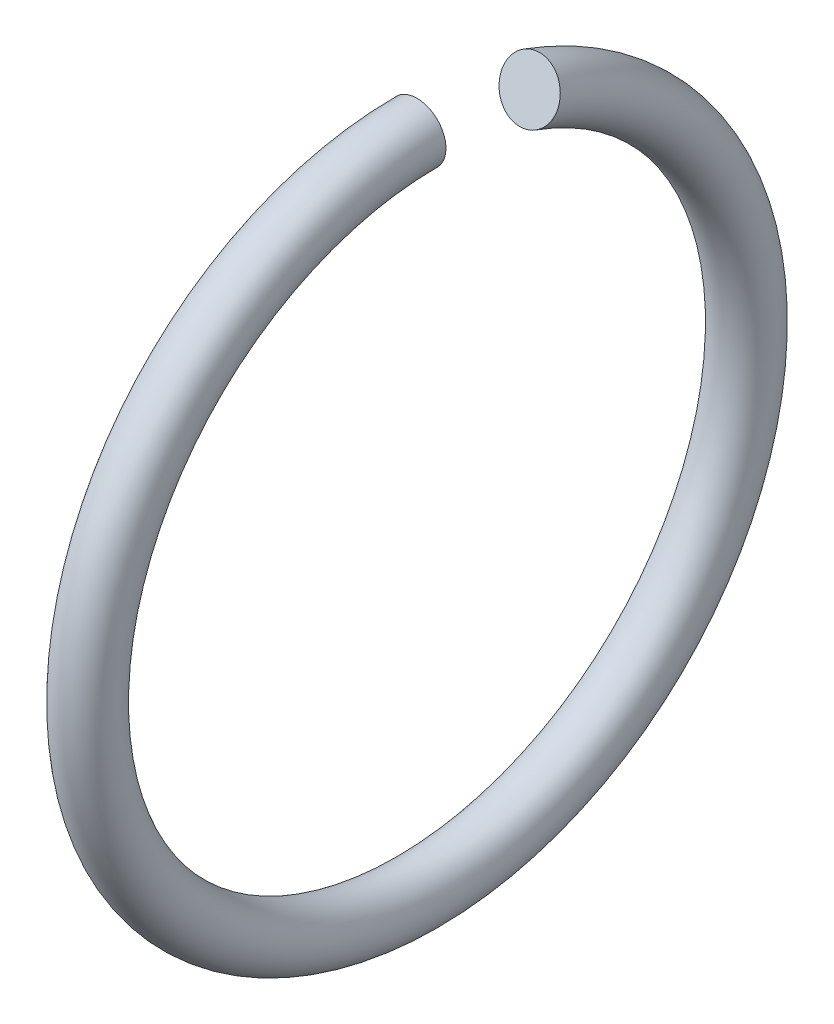
ISO-10303-21;
HEADER;
FILE_DESCRIPTION(('STEP AP214'),'2;1');
FILE_NAME('part.step','',(''),(''),'','','');
FILE_SCHEMA(('AUTOMOTIVE_DESIGN { 1 0 10303 214 1 1 1 1 }'));
ENDSEC;
DATA;
#1=APPLICATION_CONTEXT('core data for automotive mechanical design processes');
#2=APPLICATION_PROTOCOL_DEFINITION('international standard','automotive_design',2000,#1);
#3=PRODUCT_CONTEXT('',#1,'mechanical');
#4=PRODUCT('Part','Part','',(#3));
#5=PRODUCT_RELATED_PRODUCT_CATEGORY('part','',(#4));
#6=PRODUCT_DEFINITION_FORMATION('','',#4);
#7=PRODUCT_DEFINITION_CONTEXT('part definition',#1,'design');
#8=PRODUCT_DEFINITION('design','',#6,#7);
#9=PRODUCT_DEFINITION_SHAPE('','',#8);
#10=(LENGTH_UNIT() NAMED_UNIT(*) SI_UNIT(.MILLI.,.METRE.));
#11=(NAMED_UNIT(*) PLANE_ANGLE_UNIT() SI_UNIT($,.RADIAN.));
#12=(NAMED_UNIT(*) SI_UNIT($,.STERADIAN.) SOLID_ANGLE_UNIT());
#13=UNCERTAINTY_MEASURE_WITH_UNIT(LENGTH_MEASURE(1.E-05),#10,'distance_accuracy_value','');
#14=(GEOMETRIC_REPRESENTATION_CONTEXT(3) GLOBAL_UNCERTAINTY_ASSIGNED_CONTEXT((#13)) GLOBAL_UNIT_ASSIGNED_CONTEXT((#10,
#11,#12)) REPRESENTATION_CONTEXT('',''));
#15=CARTESIAN_POINT('',(0.,0.,0.));
#16=DIRECTION('',(0.,0.,1.));
#17=DIRECTION('',(1.,0.,0.));
#18=AXIS2_PLACEMENT_3D('',#15,#16,#17);
#19=CARTESIAN_POINT('',(-0.6169152,5.93630590996312,-2.16063865272498));
#20=DIRECTION('',(0.,0.342020143325752,0.939692620785878));
#21=DIRECTION('',(1.,0.,0.));
#22=AXIS2_PLACEMENT_3D('',#19,#20,#21);
#23=PLANE('',#22);
#24=CARTESIAN_POINT('',(0.,6.51601657105366,-2.37163607784867));
#25=DIRECTION('',(0.,0.342020143325601,0.939692620785933));
#26=DIRECTION('',(0.,-0.939692620785933,0.342020143325601));
#27=AXIS2_PLACEMENT_3D('',#24,#25,#26);
#28=CIRCLE('',#27,0.609600000000043);
#29=CARTESIAN_POINT('',(1.26691956128387E-13,7.08885319268464,-2.58013155721994));
#30=VERTEX_POINT('',#29);
#31=EDGE_CURVE('E18',#30,#30,#28,.F.);
#32=ORIENTED_EDGE('',*,*,#31,.F.);
#33=EDGE_LOOP('',(#32));
#34=FACE_BOUND('',#33,.T.);
#35=ADVANCED_FACE('F14',(#34),#23,.T.);
#36=CARTESIAN_POINT('',(0.6169152,6.3172848,0.));
#37=DIRECTION('',(0.,0.,-1.));
#38=DIRECTION('',(-1.,0.,0.));
#39=AXIS2_PLACEMENT_3D('',#36,#37,#38);
#40=PLANE('',#39);
#41=CARTESIAN_POINT('',(-2.95537208489675E-13,6.9342,0.));
#42=DIRECTION('',(0.,0.,1.));
#43=DIRECTION('',(0.,-1.,0.));
#44=AXIS2_PLACEMENT_3D('',#41,#42,#43);
#45=CIRCLE('',#44,0.609599999999829);
#46=CARTESIAN_POINT('',(-2.95537208489675E-13,7.54379999999983,0.));
#47=VERTEX_POINT('',#46);
#48=EDGE_CURVE('E10',#47,#47,#45,.T.);
#49=ORIENTED_EDGE('',*,*,#48,.F.);
#50=EDGE_LOOP('',(#49));
#51=FACE_BOUND('',#50,.T.);
#52=ADVANCED_FACE('F29',(#51),#40,.T.);
#53=CARTESIAN_POINT('',(-2.95537208489675E-13,0.,0.));
#54=DIRECTION('',(-1.,0.,0.));
#55=DIRECTION('',(0.,0.,1.));
#56=AXIS2_PLACEMENT_3D('',#53,#54,#55);
#57=TOROIDAL_SURFACE('',#56,6.9342,0.609599999999829);
#58=CARTESIAN_POINT('',(-2.95537208489675E-13,0.,0.));
#59=DIRECTION('',(-1.,0.,0.));
#60=DIRECTION('',(0.,0.,1.));
#61=AXIS2_PLACEMENT_3D('',#58,#59,#60);
#62=CIRCLE('',#61,7.54379999999983);
#63=EDGE_CURVE('',#30,#47,#62,.T.);
#64=ORIENTED_EDGE('',*,*,#31,.T.);
#65=ORIENTED_EDGE('',*,*,#48,.T.);
#66=ORIENTED_EDGE('',*,*,#63,.T.);
#67=ORIENTED_EDGE('',*,*,#63,.F.);
#68=EDGE_LOOP('',(#64,#66,#65,#67));
#69=FACE_BOUND('',#68,.T.);
#70=ADVANCED_FACE('F16',(#69),#57,.T.);
#71=CLOSED_SHELL('',(#35,#52,#70));
#72=MANIFOLD_SOLID_BREP('B1',#71);
#73=ADVANCED_BREP_SHAPE_REPRESENTATION('',(#18,#72),#14);
#74=SHAPE_DEFINITION_REPRESENTATION(#9,#73);
ENDSEC;
END-ISO-10303-21;
